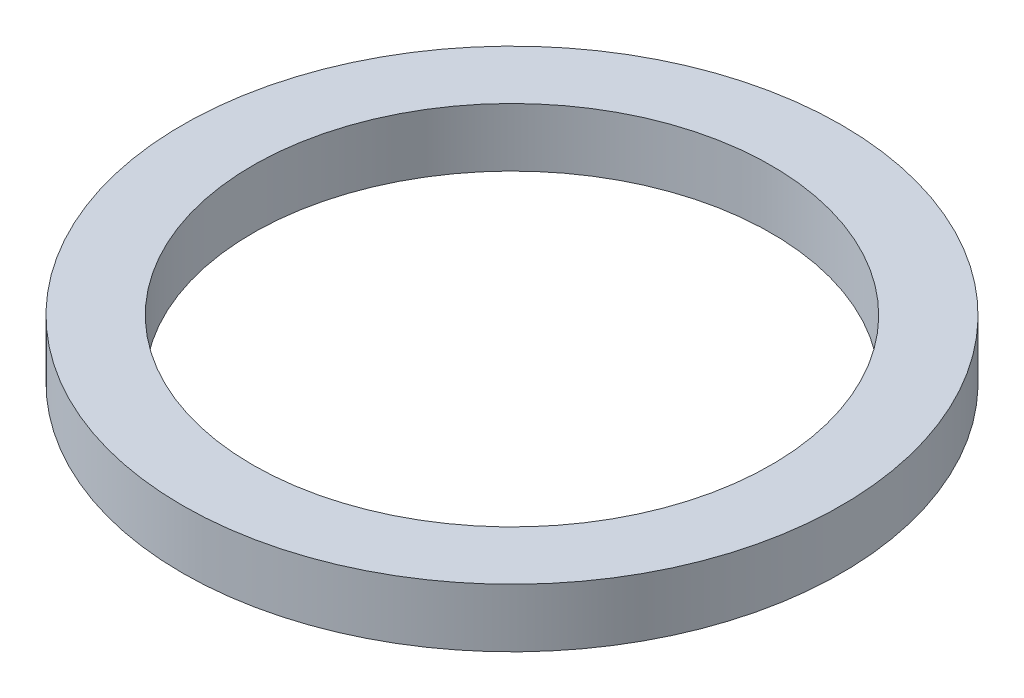
ISO-10303-21;
HEADER;
FILE_DESCRIPTION(('STEP AP214'),'2;1');
FILE_NAME('part.step','',(''),(''),'','','');
FILE_SCHEMA(('AUTOMOTIVE_DESIGN { 1 0 10303 214 1 1 1 1 }'));
ENDSEC;
DATA;
#1=APPLICATION_CONTEXT('core data for automotive mechanical design processes');
#2=APPLICATION_PROTOCOL_DEFINITION('international standard','automotive_design',2000,#1);
#3=PRODUCT_CONTEXT('',#1,'mechanical');
#4=PRODUCT('Part','Part','',(#3));
#5=PRODUCT_RELATED_PRODUCT_CATEGORY('part','',(#4));
#6=PRODUCT_DEFINITION_FORMATION('','',#4);
#7=PRODUCT_DEFINITION_CONTEXT('part definition',#1,'design');
#8=PRODUCT_DEFINITION('design','',#6,#7);
#9=PRODUCT_DEFINITION_SHAPE('','',#8);
#10=(LENGTH_UNIT() NAMED_UNIT(*) SI_UNIT(.MILLI.,.METRE.));
#11=(NAMED_UNIT(*) PLANE_ANGLE_UNIT() SI_UNIT($,.RADIAN.));
#12=(NAMED_UNIT(*) SI_UNIT($,.STERADIAN.) SOLID_ANGLE_UNIT());
#13=UNCERTAINTY_MEASURE_WITH_UNIT(LENGTH_MEASURE(1.E-05),#10,'distance_accuracy_value','');
#14=(GEOMETRIC_REPRESENTATION_CONTEXT(3) GLOBAL_UNCERTAINTY_ASSIGNED_CONTEXT((#13)) GLOBAL_UNIT_ASSIGNED_CONTEXT((#10,
#11,#12)) REPRESENTATION_CONTEXT('',''));
#15=CARTESIAN_POINT('',(0.,0.,0.));
#16=DIRECTION('',(0.,0.,1.));
#17=DIRECTION('',(1.,0.,0.));
#18=AXIS2_PLACEMENT_3D('',#15,#16,#17);
#19=CARTESIAN_POINT('',(0.,10.,0.));
#20=DIRECTION('',(0.,1.,0.));
#21=DIRECTION('',(0.,0.,1.));
#22=AXIS2_PLACEMENT_3D('',#19,#20,#21);
#23=PLANE('',#22);
#24=CARTESIAN_POINT('',(0.,10.,0.));
#25=DIRECTION('',(0.,1.,0.));
#26=DIRECTION('',(0.,0.,1.));
#27=AXIS2_PLACEMENT_3D('',#24,#25,#26);
#28=CIRCLE('',#27,56.3);
#29=CARTESIAN_POINT('',(0.,10.,56.3));
#30=VERTEX_POINT('',#29);
#31=EDGE_CURVE('E10',#30,#30,#28,.T.);
#32=ORIENTED_EDGE('',*,*,#31,.T.);
#33=EDGE_LOOP('',(#32));
#34=FACE_BOUND('',#33,.T.);
#35=CARTESIAN_POINT('',(0.,10.,0.));
#36=DIRECTION('',(0.,1.,0.));
#37=DIRECTION('',(0.,0.,1.));
#38=AXIS2_PLACEMENT_3D('',#35,#36,#37);
#39=CIRCLE('',#38,44.3);
#40=CARTESIAN_POINT('',(0.,10.,44.3));
#41=VERTEX_POINT('',#40);
#42=EDGE_CURVE('E56',#41,#41,#39,.T.);
#43=ORIENTED_EDGE('',*,*,#42,.F.);
#44=EDGE_LOOP('',(#43));
#45=FACE_BOUND('',#44,.T.);
#46=ADVANCED_FACE('F43',(#34,#45),#23,.T.);
#47=CARTESIAN_POINT('',(0.,0.,0.));
#48=DIRECTION('',(0.,1.,0.));
#49=DIRECTION('',(0.,0.,1.));
#50=AXIS2_PLACEMENT_3D('',#47,#48,#49);
#51=PLANE('',#50);
#52=CARTESIAN_POINT('',(0.,0.,0.));
#53=DIRECTION('',(0.,1.,0.));
#54=DIRECTION('',(0.,0.,1.));
#55=AXIS2_PLACEMENT_3D('',#52,#53,#54);
#56=CIRCLE('',#55,56.3);
#57=CARTESIAN_POINT('',(0.,0.,56.3));
#58=VERTEX_POINT('',#57);
#59=EDGE_CURVE('E47',#58,#58,#56,.T.);
#60=ORIENTED_EDGE('',*,*,#59,.F.);
#61=EDGE_LOOP('',(#60));
#62=FACE_BOUND('',#61,.T.);
#63=CARTESIAN_POINT('',(0.,0.,0.));
#64=DIRECTION('',(0.,1.,0.));
#65=DIRECTION('',(0.,0.,1.));
#66=AXIS2_PLACEMENT_3D('',#63,#64,#65);
#67=CIRCLE('',#66,44.3);
#68=CARTESIAN_POINT('',(0.,0.,44.3));
#69=VERTEX_POINT('',#68);
#70=EDGE_CURVE('E58',#69,#69,#67,.T.);
#71=ORIENTED_EDGE('',*,*,#70,.T.);
#72=EDGE_LOOP('',(#71));
#73=FACE_BOUND('',#72,.T.);
#74=ADVANCED_FACE('F70',(#62,#73),#51,.F.);
#75=CARTESIAN_POINT('',(0.,10.,0.));
#76=DIRECTION('',(0.,-1.,0.));
#77=DIRECTION('',(0.,0.,-1.));
#78=AXIS2_PLACEMENT_3D('',#75,#76,#77);
#79=CYLINDRICAL_SURFACE('',#78,56.3);
#80=ORIENTED_EDGE('',*,*,#31,.F.);
#81=EDGE_LOOP('',(#80));
#82=FACE_BOUND('',#81,.T.);
#83=ORIENTED_EDGE('',*,*,#59,.T.);
#84=EDGE_LOOP('',(#83));
#85=FACE_BOUND('',#84,.T.);
#86=ADVANCED_FACE('F45',(#82,#85),#79,.T.);
#87=CARTESIAN_POINT('',(0.,10.,0.));
#88=DIRECTION('',(0.,-1.,0.));
#89=DIRECTION('',(0.,0.,-1.));
#90=AXIS2_PLACEMENT_3D('',#87,#88,#89);
#91=CYLINDRICAL_SURFACE('',#90,44.3);
#92=ORIENTED_EDGE('',*,*,#42,.T.);
#93=EDGE_LOOP('',(#92));
#94=FACE_BOUND('',#93,.T.);
#95=ORIENTED_EDGE('',*,*,#70,.F.);
#96=EDGE_LOOP('',(#95));
#97=FACE_BOUND('',#96,.T.);
#98=ADVANCED_FACE('F66',(#94,#97),#91,.F.);
#99=CLOSED_SHELL('',(#46,#74,#86,#98));
#100=MANIFOLD_SOLID_BREP('B2',#99);
#101=ADVANCED_BREP_SHAPE_REPRESENTATION('',(#18,#100),#14);
#102=SHAPE_DEFINITION_REPRESENTATION(#9,#101);
ENDSEC;
END-ISO-10303-21;
